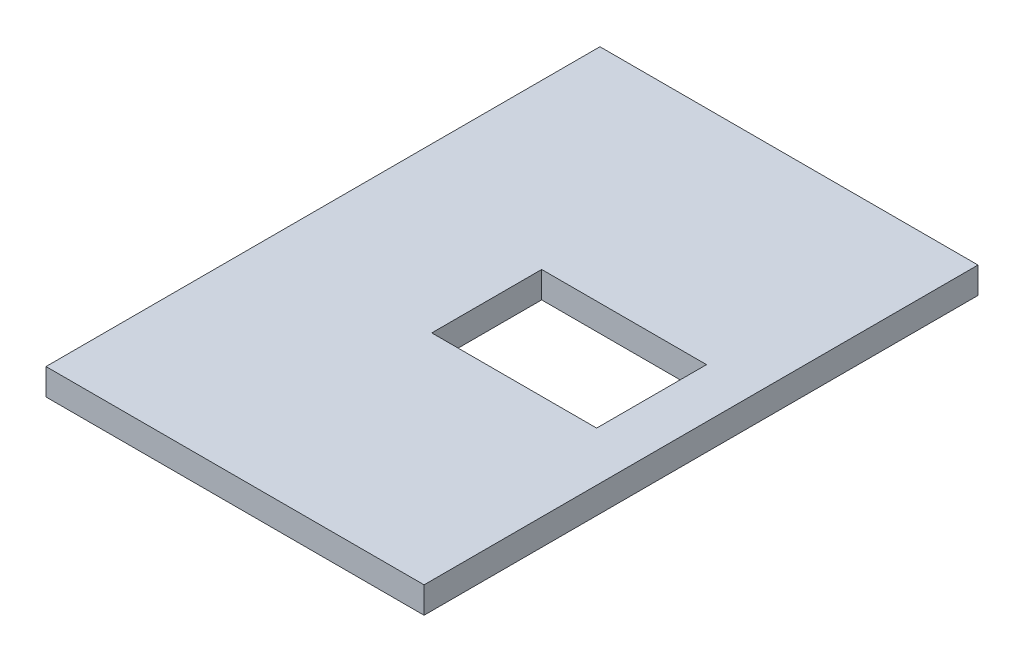
ISO-10303-21;
HEADER;
FILE_DESCRIPTION(('STEP AP214'),'2;1');
FILE_NAME('part.step','',(''),(''),'','','');
FILE_SCHEMA(('AUTOMOTIVE_DESIGN { 1 0 10303 214 1 1 1 1 }'));
ENDSEC;
DATA;
#1=APPLICATION_CONTEXT('core data for automotive mechanical design processes');
#2=APPLICATION_PROTOCOL_DEFINITION('international standard','automotive_design',2000,#1);
#3=PRODUCT_CONTEXT('',#1,'mechanical');
#4=PRODUCT('Part','Part','',(#3));
#5=PRODUCT_RELATED_PRODUCT_CATEGORY('part','',(#4));
#6=PRODUCT_DEFINITION_FORMATION('','',#4);
#7=PRODUCT_DEFINITION_CONTEXT('part definition',#1,'design');
#8=PRODUCT_DEFINITION('design','',#6,#7);
#9=PRODUCT_DEFINITION_SHAPE('','',#8);
#10=(LENGTH_UNIT() NAMED_UNIT(*) SI_UNIT(.MILLI.,.METRE.));
#11=(NAMED_UNIT(*) PLANE_ANGLE_UNIT() SI_UNIT($,.RADIAN.));
#12=(NAMED_UNIT(*) SI_UNIT($,.STERADIAN.) SOLID_ANGLE_UNIT());
#13=UNCERTAINTY_MEASURE_WITH_UNIT(LENGTH_MEASURE(1.E-05),#10,'distance_accuracy_value','');
#14=(GEOMETRIC_REPRESENTATION_CONTEXT(3) GLOBAL_UNCERTAINTY_ASSIGNED_CONTEXT((#13)) GLOBAL_UNIT_ASSIGNED_CONTEXT((#10,
#11,#12)) REPRESENTATION_CONTEXT('',''));
#15=CARTESIAN_POINT('',(0.,0.,0.));
#16=DIRECTION('',(0.,0.,1.));
#17=DIRECTION('',(1.,0.,0.));
#18=AXIS2_PLACEMENT_3D('',#15,#16,#17);
#19=CARTESIAN_POINT('',(0.,120.,0.));
#20=DIRECTION('',(0.,-1.,0.));
#21=DIRECTION('',(0.,0.,-1.));
#22=AXIS2_PLACEMENT_3D('',#19,#20,#21);
#23=PLANE('',#22);
#24=DIRECTION('',(0.,0.,1.));
#25=VECTOR('',#24,1.);
#26=CARTESIAN_POINT('',(-885.,120.,-1260.));
#27=LINE('',#26,#25);
#28=CARTESIAN_POINT('',(-885.,120.,-1260.));
#29=VERTEX_POINT('',#28);
#30=CARTESIAN_POINT('',(-885.,120.,1260.));
#31=VERTEX_POINT('',#30);
#32=EDGE_CURVE('E152',#29,#31,#27,.T.);
#33=ORIENTED_EDGE('',*,*,#32,.T.);
#34=DIRECTION('',(1.,0.,0.));
#35=VECTOR('',#34,1.);
#36=CARTESIAN_POINT('',(735.,120.,1260.));
#37=LINE('',#36,#35);
#38=CARTESIAN_POINT('',(835.,120.,1260.));
#39=VERTEX_POINT('',#38);
#40=EDGE_CURVE('E155',#31,#39,#37,.T.);
#41=ORIENTED_EDGE('',*,*,#40,.T.);
#42=DIRECTION('',(0.,0.,1.));
#43=VECTOR('',#42,1.);
#44=CARTESIAN_POINT('',(835.,120.,1260.));
#45=LINE('',#44,#43);
#46=CARTESIAN_POINT('',(835.,120.,-1260.));
#47=VERTEX_POINT('',#46);
#48=EDGE_CURVE('E122',#47,#39,#45,.T.);
#49=ORIENTED_EDGE('',*,*,#48,.F.);
#50=DIRECTION('',(-1.,0.,0.));
#51=VECTOR('',#50,1.);
#52=CARTESIAN_POINT('',(735.,120.,-1260.));
#53=LINE('',#52,#51);
#54=EDGE_CURVE('E157',#47,#29,#53,.T.);
#55=ORIENTED_EDGE('',*,*,#54,.T.);
#56=EDGE_LOOP('',(#33,#41,#49,#55));
#57=FACE_BOUND('',#56,.T.);
#58=DIRECTION('',(0.,0.,-1.));
#59=VECTOR('',#58,1.);
#60=CARTESIAN_POINT('',(610.,120.,-250.));
#61=LINE('',#60,#59);
#62=CARTESIAN_POINT('',(610.,120.,250.));
#63=VERTEX_POINT('',#62);
#64=CARTESIAN_POINT('',(610.,120.,-250.));
#65=VERTEX_POINT('',#64);
#66=EDGE_CURVE('E127',#63,#65,#61,.T.);
#67=ORIENTED_EDGE('',*,*,#66,.F.);
#68=DIRECTION('',(1.,0.,0.));
#69=VECTOR('',#68,1.);
#70=CARTESIAN_POINT('',(-140.,120.,250.));
#71=LINE('',#70,#69);
#72=CARTESIAN_POINT('',(-140.,120.,250.));
#73=VERTEX_POINT('',#72);
#74=EDGE_CURVE('E134',#73,#63,#71,.T.);
#75=ORIENTED_EDGE('',*,*,#74,.F.);
#76=DIRECTION('',(0.,0.,1.));
#77=VECTOR('',#76,1.);
#78=CARTESIAN_POINT('',(-140.,120.,-250.));
#79=LINE('',#78,#77);
#80=CARTESIAN_POINT('',(-140.,120.,-250.));
#81=VERTEX_POINT('',#80);
#82=EDGE_CURVE('E132',#81,#73,#79,.T.);
#83=ORIENTED_EDGE('',*,*,#82,.F.);
#84=DIRECTION('',(-1.,0.,0.));
#85=VECTOR('',#84,1.);
#86=CARTESIAN_POINT('',(-140.,120.,-250.));
#87=LINE('',#86,#85);
#88=EDGE_CURVE('E129',#65,#81,#87,.T.);
#89=ORIENTED_EDGE('',*,*,#88,.F.);
#90=EDGE_LOOP('',(#67,#75,#83,#89));
#91=FACE_BOUND('',#90,.T.);
#92=ADVANCED_FACE('F32',(#57,#91),#23,.F.);
#93=CARTESIAN_POINT('',(0.,0.,0.));
#94=DIRECTION('',(0.,-1.,0.));
#95=DIRECTION('',(0.,0.,-1.));
#96=AXIS2_PLACEMENT_3D('',#93,#94,#95);
#97=PLANE('',#96);
#98=DIRECTION('',(0.,0.,1.));
#99=VECTOR('',#98,1.);
#100=CARTESIAN_POINT('',(-885.,0.,-1260.));
#101=LINE('',#100,#99);
#102=CARTESIAN_POINT('',(-885.,0.,-1260.));
#103=VERTEX_POINT('',#102);
#104=CARTESIAN_POINT('',(-885.,0.,1260.));
#105=VERTEX_POINT('',#104);
#106=EDGE_CURVE('E108',#103,#105,#101,.T.);
#107=ORIENTED_EDGE('',*,*,#106,.F.);
#108=DIRECTION('',(-1.,0.,0.));
#109=VECTOR('',#108,1.);
#110=CARTESIAN_POINT('',(735.,0.,-1260.));
#111=LINE('',#110,#109);
#112=CARTESIAN_POINT('',(835.,0.,-1260.));
#113=VERTEX_POINT('',#112);
#114=EDGE_CURVE('E107',#113,#103,#111,.T.);
#115=ORIENTED_EDGE('',*,*,#114,.F.);
#116=DIRECTION('',(0.,0.,-1.));
#117=VECTOR('',#116,1.);
#118=CARTESIAN_POINT('',(835.,0.,-1260.));
#119=LINE('',#118,#117);
#120=CARTESIAN_POINT('',(835.,0.,1260.));
#121=VERTEX_POINT('',#120);
#122=EDGE_CURVE('E111',#121,#113,#119,.T.);
#123=ORIENTED_EDGE('',*,*,#122,.F.);
#124=DIRECTION('',(1.,0.,0.));
#125=VECTOR('',#124,1.);
#126=CARTESIAN_POINT('',(735.,0.,1260.));
#127=LINE('',#126,#125);
#128=EDGE_CURVE('E98',#105,#121,#127,.T.);
#129=ORIENTED_EDGE('',*,*,#128,.F.);
#130=EDGE_LOOP('',(#107,#115,#123,#129));
#131=FACE_BOUND('',#130,.T.);
#132=DIRECTION('',(1.,0.,0.));
#133=VECTOR('',#132,1.);
#134=CARTESIAN_POINT('',(-140.,0.,250.));
#135=LINE('',#134,#133);
#136=CARTESIAN_POINT('',(-140.,0.,250.));
#137=VERTEX_POINT('',#136);
#138=CARTESIAN_POINT('',(610.,0.,250.));
#139=VERTEX_POINT('',#138);
#140=EDGE_CURVE('E130',#137,#139,#135,.T.);
#141=ORIENTED_EDGE('',*,*,#140,.T.);
#142=DIRECTION('',(0.,0.,-1.));
#143=VECTOR('',#142,1.);
#144=CARTESIAN_POINT('',(610.,0.,-250.));
#145=LINE('',#144,#143);
#146=CARTESIAN_POINT('',(610.,0.,-250.));
#147=VERTEX_POINT('',#146);
#148=EDGE_CURVE('E55',#139,#147,#145,.T.);
#149=ORIENTED_EDGE('',*,*,#148,.T.);
#150=DIRECTION('',(-1.,0.,0.));
#151=VECTOR('',#150,1.);
#152=CARTESIAN_POINT('',(-140.,0.,-250.));
#153=LINE('',#152,#151);
#154=CARTESIAN_POINT('',(-140.,0.,-250.));
#155=VERTEX_POINT('',#154);
#156=EDGE_CURVE('E138',#147,#155,#153,.T.);
#157=ORIENTED_EDGE('',*,*,#156,.T.);
#158=DIRECTION('',(0.,0.,1.));
#159=VECTOR('',#158,1.);
#160=CARTESIAN_POINT('',(-140.,0.,-250.));
#161=LINE('',#160,#159);
#162=EDGE_CURVE('E141',#155,#137,#161,.T.);
#163=ORIENTED_EDGE('',*,*,#162,.T.);
#164=EDGE_LOOP('',(#141,#149,#157,#163));
#165=FACE_BOUND('',#164,.T.);
#166=ADVANCED_FACE('F112',(#131,#165),#97,.T.);
#167=CARTESIAN_POINT('',(-885.,120.,-1260.));
#168=DIRECTION('',(1.,0.,0.));
#169=DIRECTION('',(0.,0.,-1.));
#170=AXIS2_PLACEMENT_3D('',#167,#168,#169);
#171=PLANE('',#170);
#172=ORIENTED_EDGE('',*,*,#106,.T.);
#173=DIRECTION('',(0.,-1.,0.));
#174=VECTOR('',#173,1.);
#175=CARTESIAN_POINT('',(-885.,120.,1260.));
#176=LINE('',#175,#174);
#177=EDGE_CURVE('E11',#31,#105,#176,.T.);
#178=ORIENTED_EDGE('',*,*,#177,.F.);
#179=ORIENTED_EDGE('',*,*,#32,.F.);
#180=DIRECTION('',(0.,-1.,0.));
#181=VECTOR('',#180,1.);
#182=CARTESIAN_POINT('',(-885.,120.,-1260.));
#183=LINE('',#182,#181);
#184=EDGE_CURVE('E40',#29,#103,#183,.T.);
#185=ORIENTED_EDGE('',*,*,#184,.T.);
#186=EDGE_LOOP('',(#172,#178,#179,#185));
#187=FACE_BOUND('',#186,.T.);
#188=ADVANCED_FACE('F34',(#187),#171,.F.);
#189=CARTESIAN_POINT('',(735.,120.,1260.));
#190=DIRECTION('',(0.,0.,-1.));
#191=DIRECTION('',(-1.,0.,0.));
#192=AXIS2_PLACEMENT_3D('',#189,#190,#191);
#193=PLANE('',#192);
#194=ORIENTED_EDGE('',*,*,#128,.T.);
#195=DIRECTION('',(0.,-1.,0.));
#196=VECTOR('',#195,1.);
#197=CARTESIAN_POINT('',(835.,0.,1260.));
#198=LINE('',#197,#196);
#199=EDGE_CURVE('E102',#39,#121,#198,.T.);
#200=ORIENTED_EDGE('',*,*,#199,.F.);
#201=ORIENTED_EDGE('',*,*,#40,.F.);
#202=ORIENTED_EDGE('',*,*,#177,.T.);
#203=EDGE_LOOP('',(#194,#200,#201,#202));
#204=FACE_BOUND('',#203,.T.);
#205=ADVANCED_FACE('F100',(#204),#193,.F.);
#206=CARTESIAN_POINT('',(735.,120.,-1260.));
#207=DIRECTION('',(0.,0.,1.));
#208=DIRECTION('',(1.,0.,0.));
#209=AXIS2_PLACEMENT_3D('',#206,#207,#208);
#210=PLANE('',#209);
#211=ORIENTED_EDGE('',*,*,#114,.T.);
#212=ORIENTED_EDGE('',*,*,#184,.F.);
#213=ORIENTED_EDGE('',*,*,#54,.F.);
#214=DIRECTION('',(0.,1.,0.));
#215=VECTOR('',#214,1.);
#216=CARTESIAN_POINT('',(835.,120.,-1260.));
#217=LINE('',#216,#215);
#218=EDGE_CURVE('E117',#113,#47,#217,.T.);
#219=ORIENTED_EDGE('',*,*,#218,.F.);
#220=EDGE_LOOP('',(#211,#212,#213,#219));
#221=FACE_BOUND('',#220,.T.);
#222=ADVANCED_FACE('F165',(#221),#210,.F.);
#223=CARTESIAN_POINT('',(610.,120.,-250.));
#224=DIRECTION('',(-1.,0.,0.));
#225=DIRECTION('',(0.,0.,1.));
#226=AXIS2_PLACEMENT_3D('',#223,#224,#225);
#227=PLANE('',#226);
#228=ORIENTED_EDGE('',*,*,#148,.F.);
#229=DIRECTION('',(0.,-1.,0.));
#230=VECTOR('',#229,1.);
#231=CARTESIAN_POINT('',(610.,120.,250.));
#232=LINE('',#231,#230);
#233=EDGE_CURVE('E136',#63,#139,#232,.T.);
#234=ORIENTED_EDGE('',*,*,#233,.F.);
#235=ORIENTED_EDGE('',*,*,#66,.T.);
#236=DIRECTION('',(0.,-1.,0.));
#237=VECTOR('',#236,1.);
#238=CARTESIAN_POINT('',(610.,120.,-250.));
#239=LINE('',#238,#237);
#240=EDGE_CURVE('E150',#65,#147,#239,.T.);
#241=ORIENTED_EDGE('',*,*,#240,.T.);
#242=EDGE_LOOP('',(#228,#234,#235,#241));
#243=FACE_BOUND('',#242,.T.);
#244=ADVANCED_FACE('F175',(#243),#227,.T.);
#245=CARTESIAN_POINT('',(-140.,120.,-250.));
#246=DIRECTION('',(0.,0.,1.));
#247=DIRECTION('',(1.,0.,0.));
#248=AXIS2_PLACEMENT_3D('',#245,#246,#247);
#249=PLANE('',#248);
#250=ORIENTED_EDGE('',*,*,#156,.F.);
#251=ORIENTED_EDGE('',*,*,#240,.F.);
#252=ORIENTED_EDGE('',*,*,#88,.T.);
#253=DIRECTION('',(0.,-1.,0.));
#254=VECTOR('',#253,1.);
#255=CARTESIAN_POINT('',(-140.,120.,-250.));
#256=LINE('',#255,#254);
#257=EDGE_CURVE('E148',#81,#155,#256,.T.);
#258=ORIENTED_EDGE('',*,*,#257,.T.);
#259=EDGE_LOOP('',(#250,#251,#252,#258));
#260=FACE_BOUND('',#259,.T.);
#261=ADVANCED_FACE('F177',(#260),#249,.T.);
#262=CARTESIAN_POINT('',(-140.,120.,-250.));
#263=DIRECTION('',(1.,0.,0.));
#264=DIRECTION('',(0.,0.,-1.));
#265=AXIS2_PLACEMENT_3D('',#262,#263,#264);
#266=PLANE('',#265);
#267=ORIENTED_EDGE('',*,*,#162,.F.);
#268=ORIENTED_EDGE('',*,*,#257,.F.);
#269=ORIENTED_EDGE('',*,*,#82,.T.);
#270=DIRECTION('',(0.,-1.,0.));
#271=VECTOR('',#270,1.);
#272=CARTESIAN_POINT('',(-140.,120.,250.));
#273=LINE('',#272,#271);
#274=EDGE_CURVE('E47',#73,#137,#273,.T.);
#275=ORIENTED_EDGE('',*,*,#274,.T.);
#276=EDGE_LOOP('',(#267,#268,#269,#275));
#277=FACE_BOUND('',#276,.T.);
#278=ADVANCED_FACE('F182',(#277),#266,.T.);
#279=CARTESIAN_POINT('',(-140.,120.,250.));
#280=DIRECTION('',(0.,0.,-1.));
#281=DIRECTION('',(-1.,0.,0.));
#282=AXIS2_PLACEMENT_3D('',#279,#280,#281);
#283=PLANE('',#282);
#284=ORIENTED_EDGE('',*,*,#140,.F.);
#285=ORIENTED_EDGE('',*,*,#274,.F.);
#286=ORIENTED_EDGE('',*,*,#74,.T.);
#287=ORIENTED_EDGE('',*,*,#233,.T.);
#288=EDGE_LOOP('',(#284,#285,#286,#287));
#289=FACE_BOUND('',#288,.T.);
#290=ADVANCED_FACE('F180',(#289),#283,.T.);
#291=CARTESIAN_POINT('',(835.,0.,-1.10361455424048E-13));
#292=DIRECTION('',(-1.,0.,0.));
#293=DIRECTION('',(0.,0.,1.));
#294=AXIS2_PLACEMENT_3D('',#291,#292,#293);
#295=PLANE('',#294);
#296=ORIENTED_EDGE('',*,*,#199,.T.);
#297=ORIENTED_EDGE('',*,*,#122,.T.);
#298=ORIENTED_EDGE('',*,*,#218,.T.);
#299=ORIENTED_EDGE('',*,*,#48,.T.);
#300=EDGE_LOOP('',(#296,#297,#298,#299));
#301=FACE_BOUND('',#300,.T.);
#302=ADVANCED_FACE('F120',(#301),#295,.F.);
#303=CLOSED_SHELL('',(#92,#166,#188,#205,#222,#244,#261,#278,#290,#302));
#304=MANIFOLD_SOLID_BREP('B2',#303);
#305=ADVANCED_BREP_SHAPE_REPRESENTATION('',(#18,#304),#14);
#306=SHAPE_DEFINITION_REPRESENTATION(#9,#305);
ENDSEC;
END-ISO-10303-21;
